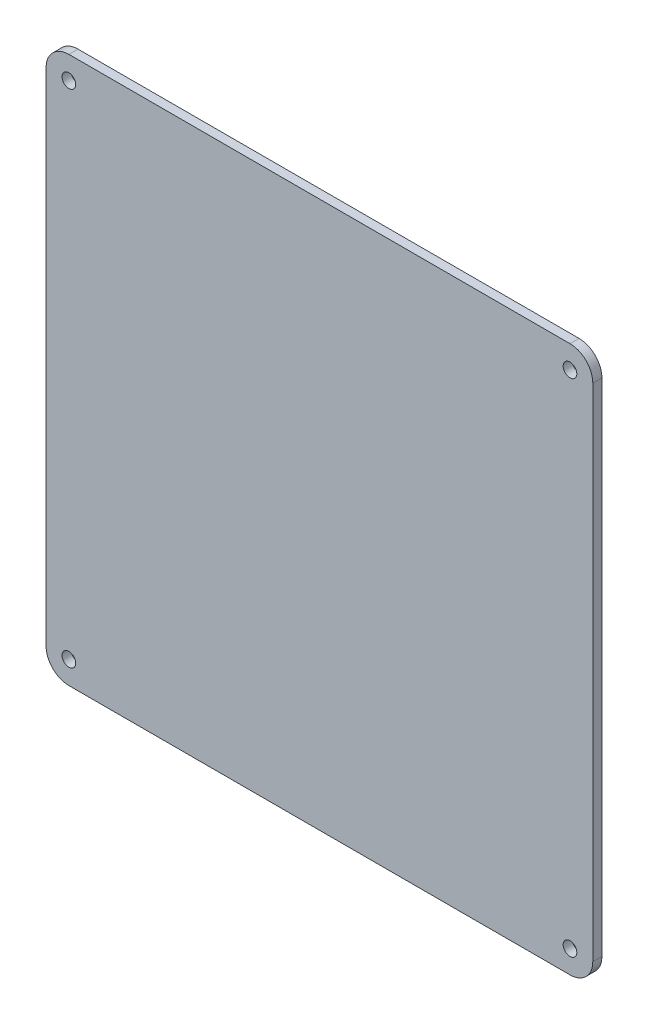
ISO-10303-21;
HEADER;
FILE_DESCRIPTION(('STEP AP214'),'2;1');
FILE_NAME('part.step','',(''),(''),'','','');
FILE_SCHEMA(('AUTOMOTIVE_DESIGN { 1 0 10303 214 1 1 1 1 }'));
ENDSEC;
DATA;
#1=APPLICATION_CONTEXT('core data for automotive mechanical design processes');
#2=APPLICATION_PROTOCOL_DEFINITION('international standard','automotive_design',2000,#1);
#3=PRODUCT_CONTEXT('',#1,'mechanical');
#4=PRODUCT('Part','Part','',(#3));
#5=PRODUCT_RELATED_PRODUCT_CATEGORY('part','',(#4));
#6=PRODUCT_DEFINITION_FORMATION('','',#4);
#7=PRODUCT_DEFINITION_CONTEXT('part definition',#1,'design');
#8=PRODUCT_DEFINITION('design','',#6,#7);
#9=PRODUCT_DEFINITION_SHAPE('','',#8);
#10=(LENGTH_UNIT() NAMED_UNIT(*) SI_UNIT(.MILLI.,.METRE.));
#11=(NAMED_UNIT(*) PLANE_ANGLE_UNIT() SI_UNIT($,.RADIAN.));
#12=(NAMED_UNIT(*) SI_UNIT($,.STERADIAN.) SOLID_ANGLE_UNIT());
#13=UNCERTAINTY_MEASURE_WITH_UNIT(LENGTH_MEASURE(1.E-05),#10,'distance_accuracy_value','');
#14=(GEOMETRIC_REPRESENTATION_CONTEXT(3) GLOBAL_UNCERTAINTY_ASSIGNED_CONTEXT((#13)) GLOBAL_UNIT_ASSIGNED_CONTEXT((#10,
#11,#12)) REPRESENTATION_CONTEXT('',''));
#15=CARTESIAN_POINT('',(0.,0.,0.));
#16=DIRECTION('',(0.,0.,1.));
#17=DIRECTION('',(1.,0.,0.));
#18=AXIS2_PLACEMENT_3D('',#15,#16,#17);
#19=CARTESIAN_POINT('',(55.,-55.,2.));
#20=DIRECTION('',(0.,0.,1.));
#21=DIRECTION('',(1.,0.,0.));
#22=AXIS2_PLACEMENT_3D('',#19,#20,#21);
#23=PLANE('',#22);
#24=CARTESIAN_POINT('',(-55.,-55.,2.));
#25=DIRECTION('',(0.,0.,1.));
#26=DIRECTION('',(-1.,0.,0.));
#27=AXIS2_PLACEMENT_3D('',#24,#25,#26);
#28=CIRCLE('',#27,1.5);
#29=CARTESIAN_POINT('',(-56.5,-55.,2.));
#30=VERTEX_POINT('',#29);
#31=EDGE_CURVE('E188',#30,#30,#28,.T.);
#32=ORIENTED_EDGE('',*,*,#31,.F.);
#33=EDGE_LOOP('',(#32));
#34=FACE_BOUND('',#33,.T.);
#35=CARTESIAN_POINT('',(-55.,55.,2.));
#36=DIRECTION('',(0.,0.,1.));
#37=DIRECTION('',(1.,0.,0.));
#38=AXIS2_PLACEMENT_3D('',#35,#36,#37);
#39=CIRCLE('',#38,1.5);
#40=CARTESIAN_POINT('',(-53.5,55.,2.));
#41=VERTEX_POINT('',#40);
#42=EDGE_CURVE('E134',#41,#41,#39,.T.);
#43=ORIENTED_EDGE('',*,*,#42,.F.);
#44=EDGE_LOOP('',(#43));
#45=FACE_BOUND('',#44,.T.);
#46=CARTESIAN_POINT('',(55.,-55.,2.));
#47=DIRECTION('',(0.,0.,1.));
#48=DIRECTION('',(1.,0.,0.));
#49=AXIS2_PLACEMENT_3D('',#46,#47,#48);
#50=CIRCLE('',#49,4.99999999999999);
#51=CARTESIAN_POINT('',(55.,-60.,2.));
#52=VERTEX_POINT('',#51);
#53=CARTESIAN_POINT('',(60.,-55.,2.));
#54=VERTEX_POINT('',#53);
#55=EDGE_CURVE('E145',#52,#54,#50,.T.);
#56=ORIENTED_EDGE('',*,*,#55,.T.);
#57=DIRECTION('',(0.,1.,0.));
#58=VECTOR('',#57,1.);
#59=CARTESIAN_POINT('',(60.,55.,2.));
#60=LINE('',#59,#58);
#61=CARTESIAN_POINT('',(60.,55.,2.));
#62=VERTEX_POINT('',#61);
#63=EDGE_CURVE('E93',#54,#62,#60,.T.);
#64=ORIENTED_EDGE('',*,*,#63,.T.);
#65=CARTESIAN_POINT('',(55.,55.,2.));
#66=DIRECTION('',(0.,0.,1.));
#67=DIRECTION('',(-1.,0.,0.));
#68=AXIS2_PLACEMENT_3D('',#65,#66,#67);
#69=CIRCLE('',#68,5.);
#70=CARTESIAN_POINT('',(55.,60.,2.));
#71=VERTEX_POINT('',#70);
#72=EDGE_CURVE('E160',#62,#71,#69,.T.);
#73=ORIENTED_EDGE('',*,*,#72,.T.);
#74=DIRECTION('',(-1.,0.,0.));
#75=VECTOR('',#74,1.);
#76=CARTESIAN_POINT('',(-55.,60.,2.));
#77=LINE('',#76,#75);
#78=CARTESIAN_POINT('',(-55.,60.,2.));
#79=VERTEX_POINT('',#78);
#80=EDGE_CURVE('E173',#71,#79,#77,.T.);
#81=ORIENTED_EDGE('',*,*,#80,.T.);
#82=CARTESIAN_POINT('',(-55.,55.,2.));
#83=DIRECTION('',(0.,0.,1.));
#84=DIRECTION('',(1.,0.,0.));
#85=AXIS2_PLACEMENT_3D('',#82,#83,#84);
#86=CIRCLE('',#85,5.);
#87=CARTESIAN_POINT('',(-60.,55.,2.));
#88=VERTEX_POINT('',#87);
#89=EDGE_CURVE('E112',#79,#88,#86,.T.);
#90=ORIENTED_EDGE('',*,*,#89,.T.);
#91=DIRECTION('',(0.,-1.,0.));
#92=VECTOR('',#91,1.);
#93=CARTESIAN_POINT('',(-60.,55.,2.));
#94=LINE('',#93,#92);
#95=CARTESIAN_POINT('',(-60.,-55.,2.));
#96=VERTEX_POINT('',#95);
#97=EDGE_CURVE('E106',#88,#96,#94,.T.);
#98=ORIENTED_EDGE('',*,*,#97,.T.);
#99=CARTESIAN_POINT('',(-55.,-55.,2.));
#100=DIRECTION('',(0.,0.,1.));
#101=DIRECTION('',(1.,0.,0.));
#102=AXIS2_PLACEMENT_3D('',#99,#100,#101);
#103=CIRCLE('',#102,5.);
#104=CARTESIAN_POINT('',(-55.,-60.,2.));
#105=VERTEX_POINT('',#104);
#106=EDGE_CURVE('E110',#96,#105,#103,.T.);
#107=ORIENTED_EDGE('',*,*,#106,.T.);
#108=DIRECTION('',(1.,0.,0.));
#109=VECTOR('',#108,1.);
#110=CARTESIAN_POINT('',(-55.,-60.,2.));
#111=LINE('',#110,#109);
#112=EDGE_CURVE('E50',#105,#52,#111,.T.);
#113=ORIENTED_EDGE('',*,*,#112,.T.);
#114=EDGE_LOOP('',(#56,#64,#73,#81,#90,#98,#107,#113));
#115=FACE_BOUND('',#114,.T.);
#116=CARTESIAN_POINT('',(55.,55.,2.));
#117=DIRECTION('',(0.,0.,1.));
#118=DIRECTION('',(-1.,0.,0.));
#119=AXIS2_PLACEMENT_3D('',#116,#117,#118);
#120=CIRCLE('',#119,1.5);
#121=CARTESIAN_POINT('',(53.5,55.,2.));
#122=VERTEX_POINT('',#121);
#123=EDGE_CURVE('E182',#122,#122,#120,.T.);
#124=ORIENTED_EDGE('',*,*,#123,.F.);
#125=EDGE_LOOP('',(#124));
#126=FACE_BOUND('',#125,.T.);
#127=CARTESIAN_POINT('',(55.,-55.,2.));
#128=DIRECTION('',(0.,0.,1.));
#129=DIRECTION('',(1.,0.,0.));
#130=AXIS2_PLACEMENT_3D('',#127,#128,#129);
#131=CIRCLE('',#130,1.5);
#132=CARTESIAN_POINT('',(56.5,-55.,2.));
#133=VERTEX_POINT('',#132);
#134=EDGE_CURVE('E194',#133,#133,#131,.T.);
#135=ORIENTED_EDGE('',*,*,#134,.F.);
#136=EDGE_LOOP('',(#135));
#137=FACE_BOUND('',#136,.T.);
#138=ADVANCED_FACE('F33',(#34,#45,#115,#126,#137),#23,.T.);
#139=CARTESIAN_POINT('',(55.,-55.,0.));
#140=DIRECTION('',(0.,0.,1.));
#141=DIRECTION('',(1.,0.,0.));
#142=AXIS2_PLACEMENT_3D('',#139,#140,#141);
#143=PLANE('',#142);
#144=CARTESIAN_POINT('',(55.,-55.,0.));
#145=DIRECTION('',(0.,0.,1.));
#146=DIRECTION('',(1.,0.,0.));
#147=AXIS2_PLACEMENT_3D('',#144,#145,#146);
#148=CIRCLE('',#147,4.99999999999999);
#149=CARTESIAN_POINT('',(55.,-60.,0.));
#150=VERTEX_POINT('',#149);
#151=CARTESIAN_POINT('',(60.,-55.,0.));
#152=VERTEX_POINT('',#151);
#153=EDGE_CURVE('E130',#150,#152,#148,.T.);
#154=ORIENTED_EDGE('',*,*,#153,.F.);
#155=DIRECTION('',(1.,0.,0.));
#156=VECTOR('',#155,1.);
#157=CARTESIAN_POINT('',(-55.,-60.,0.));
#158=LINE('',#157,#156);
#159=CARTESIAN_POINT('',(-55.,-60.,0.));
#160=VERTEX_POINT('',#159);
#161=EDGE_CURVE('E85',#160,#150,#158,.T.);
#162=ORIENTED_EDGE('',*,*,#161,.F.);
#163=CARTESIAN_POINT('',(-55.,-55.,0.));
#164=DIRECTION('',(0.,0.,1.));
#165=DIRECTION('',(1.,0.,0.));
#166=AXIS2_PLACEMENT_3D('',#163,#164,#165);
#167=CIRCLE('',#166,5.);
#168=CARTESIAN_POINT('',(-60.,-55.,0.));
#169=VERTEX_POINT('',#168);
#170=EDGE_CURVE('E79',#169,#160,#167,.T.);
#171=ORIENTED_EDGE('',*,*,#170,.F.);
#172=DIRECTION('',(0.,-1.,0.));
#173=VECTOR('',#172,1.);
#174=CARTESIAN_POINT('',(-60.,55.,0.));
#175=LINE('',#174,#173);
#176=CARTESIAN_POINT('',(-60.,55.,0.));
#177=VERTEX_POINT('',#176);
#178=EDGE_CURVE('E120',#177,#169,#175,.T.);
#179=ORIENTED_EDGE('',*,*,#178,.F.);
#180=CARTESIAN_POINT('',(-55.,55.,0.));
#181=DIRECTION('',(0.,0.,1.));
#182=DIRECTION('',(1.,0.,0.));
#183=AXIS2_PLACEMENT_3D('',#180,#181,#182);
#184=CIRCLE('',#183,5.);
#185=CARTESIAN_POINT('',(-55.,60.,0.));
#186=VERTEX_POINT('',#185);
#187=EDGE_CURVE('E140',#186,#177,#184,.T.);
#188=ORIENTED_EDGE('',*,*,#187,.F.);
#189=DIRECTION('',(-1.,0.,0.));
#190=VECTOR('',#189,1.);
#191=CARTESIAN_POINT('',(-55.,60.,0.));
#192=LINE('',#191,#190);
#193=CARTESIAN_POINT('',(55.,60.,0.));
#194=VERTEX_POINT('',#193);
#195=EDGE_CURVE('E138',#194,#186,#192,.T.);
#196=ORIENTED_EDGE('',*,*,#195,.F.);
#197=CARTESIAN_POINT('',(55.,55.,0.));
#198=DIRECTION('',(0.,0.,1.));
#199=DIRECTION('',(-1.,0.,0.));
#200=AXIS2_PLACEMENT_3D('',#197,#198,#199);
#201=CIRCLE('',#200,5.);
#202=CARTESIAN_POINT('',(60.,55.,0.));
#203=VERTEX_POINT('',#202);
#204=EDGE_CURVE('E136',#203,#194,#201,.T.);
#205=ORIENTED_EDGE('',*,*,#204,.F.);
#206=DIRECTION('',(0.,1.,0.));
#207=VECTOR('',#206,1.);
#208=CARTESIAN_POINT('',(60.,55.,0.));
#209=LINE('',#208,#207);
#210=EDGE_CURVE('E133',#152,#203,#209,.T.);
#211=ORIENTED_EDGE('',*,*,#210,.F.);
#212=EDGE_LOOP('',(#154,#162,#171,#179,#188,#196,#205,#211));
#213=FACE_BOUND('',#212,.T.);
#214=CARTESIAN_POINT('',(-55.,55.,0.));
#215=DIRECTION('',(0.,0.,1.));
#216=DIRECTION('',(1.,0.,0.));
#217=AXIS2_PLACEMENT_3D('',#214,#215,#216);
#218=CIRCLE('',#217,1.5);
#219=CARTESIAN_POINT('',(-53.5,55.,0.));
#220=VERTEX_POINT('',#219);
#221=EDGE_CURVE('E179',#220,#220,#218,.T.);
#222=ORIENTED_EDGE('',*,*,#221,.T.);
#223=EDGE_LOOP('',(#222));
#224=FACE_BOUND('',#223,.T.);
#225=CARTESIAN_POINT('',(55.,55.,0.));
#226=DIRECTION('',(0.,0.,1.));
#227=DIRECTION('',(-1.,0.,0.));
#228=AXIS2_PLACEMENT_3D('',#225,#226,#227);
#229=CIRCLE('',#228,1.5);
#230=CARTESIAN_POINT('',(53.5,55.,0.));
#231=VERTEX_POINT('',#230);
#232=EDGE_CURVE('E185',#231,#231,#229,.T.);
#233=ORIENTED_EDGE('',*,*,#232,.T.);
#234=EDGE_LOOP('',(#233));
#235=FACE_BOUND('',#234,.T.);
#236=CARTESIAN_POINT('',(-55.,-55.,0.));
#237=DIRECTION('',(0.,0.,1.));
#238=DIRECTION('',(-1.,0.,0.));
#239=AXIS2_PLACEMENT_3D('',#236,#237,#238);
#240=CIRCLE('',#239,1.5);
#241=CARTESIAN_POINT('',(-56.5,-55.,0.));
#242=VERTEX_POINT('',#241);
#243=EDGE_CURVE('E191',#242,#242,#240,.T.);
#244=ORIENTED_EDGE('',*,*,#243,.T.);
#245=EDGE_LOOP('',(#244));
#246=FACE_BOUND('',#245,.T.);
#247=CARTESIAN_POINT('',(55.,-55.,0.));
#248=DIRECTION('',(0.,0.,1.));
#249=DIRECTION('',(1.,0.,0.));
#250=AXIS2_PLACEMENT_3D('',#247,#248,#249);
#251=CIRCLE('',#250,1.5);
#252=CARTESIAN_POINT('',(56.5,-55.,0.));
#253=VERTEX_POINT('',#252);
#254=EDGE_CURVE('E197',#253,#253,#251,.T.);
#255=ORIENTED_EDGE('',*,*,#254,.T.);
#256=EDGE_LOOP('',(#255));
#257=FACE_BOUND('',#256,.T.);
#258=ADVANCED_FACE('F164',(#213,#224,#235,#246,#257),#143,.F.);
#259=CARTESIAN_POINT('',(55.,-55.,2.));
#260=DIRECTION('',(0.,0.,-1.));
#261=DIRECTION('',(-1.,0.,0.));
#262=AXIS2_PLACEMENT_3D('',#259,#260,#261);
#263=CYLINDRICAL_SURFACE('',#262,4.99999999999999);
#264=ORIENTED_EDGE('',*,*,#153,.T.);
#265=DIRECTION('',(0.,0.,-1.));
#266=VECTOR('',#265,1.);
#267=CARTESIAN_POINT('',(60.,-55.,2.));
#268=LINE('',#267,#266);
#269=EDGE_CURVE('E11',#54,#152,#268,.T.);
#270=ORIENTED_EDGE('',*,*,#269,.F.);
#271=ORIENTED_EDGE('',*,*,#55,.F.);
#272=DIRECTION('',(0.,0.,-1.));
#273=VECTOR('',#272,1.);
#274=CARTESIAN_POINT('',(55.,-60.,2.));
#275=LINE('',#274,#273);
#276=EDGE_CURVE('E126',#52,#150,#275,.T.);
#277=ORIENTED_EDGE('',*,*,#276,.T.);
#278=EDGE_LOOP('',(#264,#270,#271,#277));
#279=FACE_BOUND('',#278,.T.);
#280=ADVANCED_FACE('F35',(#279),#263,.T.);
#281=CARTESIAN_POINT('',(60.,55.,2.));
#282=DIRECTION('',(-1.,0.,0.));
#283=DIRECTION('',(0.,-1.,0.));
#284=AXIS2_PLACEMENT_3D('',#281,#282,#283);
#285=PLANE('',#284);
#286=ORIENTED_EDGE('',*,*,#210,.T.);
#287=DIRECTION('',(0.,0.,-1.));
#288=VECTOR('',#287,1.);
#289=CARTESIAN_POINT('',(60.,55.,2.));
#290=LINE('',#289,#288);
#291=EDGE_CURVE('E42',#62,#203,#290,.T.);
#292=ORIENTED_EDGE('',*,*,#291,.F.);
#293=ORIENTED_EDGE('',*,*,#63,.F.);
#294=ORIENTED_EDGE('',*,*,#269,.T.);
#295=EDGE_LOOP('',(#286,#292,#293,#294));
#296=FACE_BOUND('',#295,.T.);
#297=ADVANCED_FACE('F231',(#296),#285,.F.);
#298=CARTESIAN_POINT('',(55.,55.,2.));
#299=DIRECTION('',(0.,0.,-1.));
#300=DIRECTION('',(-1.,0.,0.));
#301=AXIS2_PLACEMENT_3D('',#298,#299,#300);
#302=CYLINDRICAL_SURFACE('',#301,5.);
#303=ORIENTED_EDGE('',*,*,#204,.T.);
#304=DIRECTION('',(0.,0.,-1.));
#305=VECTOR('',#304,1.);
#306=CARTESIAN_POINT('',(55.,60.,2.));
#307=LINE('',#306,#305);
#308=EDGE_CURVE('E152',#71,#194,#307,.T.);
#309=ORIENTED_EDGE('',*,*,#308,.F.);
#310=ORIENTED_EDGE('',*,*,#72,.F.);
#311=ORIENTED_EDGE('',*,*,#291,.T.);
#312=EDGE_LOOP('',(#303,#309,#310,#311));
#313=FACE_BOUND('',#312,.T.);
#314=ADVANCED_FACE('F158',(#313),#302,.T.);
#315=CARTESIAN_POINT('',(-55.,60.,2.));
#316=DIRECTION('',(0.,-1.,0.));
#317=DIRECTION('',(0.,0.,-1.));
#318=AXIS2_PLACEMENT_3D('',#315,#316,#317);
#319=PLANE('',#318);
#320=ORIENTED_EDGE('',*,*,#195,.T.);
#321=DIRECTION('',(0.,0.,-1.));
#322=VECTOR('',#321,1.);
#323=CARTESIAN_POINT('',(-55.,60.,2.));
#324=LINE('',#323,#322);
#325=EDGE_CURVE('E149',#79,#186,#324,.T.);
#326=ORIENTED_EDGE('',*,*,#325,.F.);
#327=ORIENTED_EDGE('',*,*,#80,.F.);
#328=ORIENTED_EDGE('',*,*,#308,.T.);
#329=EDGE_LOOP('',(#320,#326,#327,#328));
#330=FACE_BOUND('',#329,.T.);
#331=ADVANCED_FACE('F169',(#330),#319,.F.);
#332=CARTESIAN_POINT('',(-55.,55.,2.));
#333=DIRECTION('',(0.,0.,-1.));
#334=DIRECTION('',(-1.,0.,0.));
#335=AXIS2_PLACEMENT_3D('',#332,#333,#334);
#336=CYLINDRICAL_SURFACE('',#335,5.);
#337=ORIENTED_EDGE('',*,*,#187,.T.);
#338=DIRECTION('',(0.,0.,-1.));
#339=VECTOR('',#338,1.);
#340=CARTESIAN_POINT('',(-60.,55.,2.));
#341=LINE('',#340,#339);
#342=EDGE_CURVE('E121',#88,#177,#341,.T.);
#343=ORIENTED_EDGE('',*,*,#342,.F.);
#344=ORIENTED_EDGE('',*,*,#89,.F.);
#345=ORIENTED_EDGE('',*,*,#325,.T.);
#346=EDGE_LOOP('',(#337,#343,#344,#345));
#347=FACE_BOUND('',#346,.T.);
#348=ADVANCED_FACE('F172',(#347),#336,.T.);
#349=CARTESIAN_POINT('',(-60.,55.,2.));
#350=DIRECTION('',(1.,0.,0.));
#351=DIRECTION('',(0.,1.,0.));
#352=AXIS2_PLACEMENT_3D('',#349,#350,#351);
#353=PLANE('',#352);
#354=ORIENTED_EDGE('',*,*,#178,.T.);
#355=DIRECTION('',(0.,0.,-1.));
#356=VECTOR('',#355,1.);
#357=CARTESIAN_POINT('',(-60.,-55.,2.));
#358=LINE('',#357,#356);
#359=EDGE_CURVE('E117',#96,#169,#358,.T.);
#360=ORIENTED_EDGE('',*,*,#359,.F.);
#361=ORIENTED_EDGE('',*,*,#97,.F.);
#362=ORIENTED_EDGE('',*,*,#342,.T.);
#363=EDGE_LOOP('',(#354,#360,#361,#362));
#364=FACE_BOUND('',#363,.T.);
#365=ADVANCED_FACE('F118',(#364),#353,.F.);
#366=CARTESIAN_POINT('',(-55.,-55.,2.));
#367=DIRECTION('',(0.,0.,-1.));
#368=DIRECTION('',(-1.,0.,0.));
#369=AXIS2_PLACEMENT_3D('',#366,#367,#368);
#370=CYLINDRICAL_SURFACE('',#369,5.);
#371=ORIENTED_EDGE('',*,*,#170,.T.);
#372=DIRECTION('',(0.,0.,-1.));
#373=VECTOR('',#372,1.);
#374=CARTESIAN_POINT('',(-55.,-60.,2.));
#375=LINE('',#374,#373);
#376=EDGE_CURVE('E122',#105,#160,#375,.T.);
#377=ORIENTED_EDGE('',*,*,#376,.F.);
#378=ORIENTED_EDGE('',*,*,#106,.F.);
#379=ORIENTED_EDGE('',*,*,#359,.T.);
#380=EDGE_LOOP('',(#371,#377,#378,#379));
#381=FACE_BOUND('',#380,.T.);
#382=ADVANCED_FACE('F124',(#381),#370,.T.);
#383=CARTESIAN_POINT('',(-55.,-60.,2.));
#384=DIRECTION('',(0.,1.,0.));
#385=DIRECTION('',(0.,0.,1.));
#386=AXIS2_PLACEMENT_3D('',#383,#384,#385);
#387=PLANE('',#386);
#388=ORIENTED_EDGE('',*,*,#161,.T.);
#389=ORIENTED_EDGE('',*,*,#276,.F.);
#390=ORIENTED_EDGE('',*,*,#112,.F.);
#391=ORIENTED_EDGE('',*,*,#376,.T.);
#392=EDGE_LOOP('',(#388,#389,#390,#391));
#393=FACE_BOUND('',#392,.T.);
#394=ADVANCED_FACE('F219',(#393),#387,.F.);
#395=CARTESIAN_POINT('',(-55.,55.,2.));
#396=DIRECTION('',(0.,0.,-1.));
#397=DIRECTION('',(-1.,0.,0.));
#398=AXIS2_PLACEMENT_3D('',#395,#396,#397);
#399=CYLINDRICAL_SURFACE('',#398,1.5);
#400=ORIENTED_EDGE('',*,*,#42,.T.);
#401=EDGE_LOOP('',(#400));
#402=FACE_BOUND('',#401,.T.);
#403=ORIENTED_EDGE('',*,*,#221,.F.);
#404=EDGE_LOOP('',(#403));
#405=FACE_BOUND('',#404,.T.);
#406=ADVANCED_FACE('F216',(#402,#405),#399,.F.);
#407=CARTESIAN_POINT('',(55.,55.,2.));
#408=DIRECTION('',(0.,0.,-1.));
#409=DIRECTION('',(-1.,0.,0.));
#410=AXIS2_PLACEMENT_3D('',#407,#408,#409);
#411=CYLINDRICAL_SURFACE('',#410,1.5);
#412=ORIENTED_EDGE('',*,*,#123,.T.);
#413=EDGE_LOOP('',(#412));
#414=FACE_BOUND('',#413,.T.);
#415=ORIENTED_EDGE('',*,*,#232,.F.);
#416=EDGE_LOOP('',(#415));
#417=FACE_BOUND('',#416,.T.);
#418=ADVANCED_FACE('F295',(#414,#417),#411,.F.);
#419=CARTESIAN_POINT('',(-55.,-55.,2.));
#420=DIRECTION('',(0.,0.,-1.));
#421=DIRECTION('',(-1.,0.,0.));
#422=AXIS2_PLACEMENT_3D('',#419,#420,#421);
#423=CYLINDRICAL_SURFACE('',#422,1.5);
#424=ORIENTED_EDGE('',*,*,#31,.T.);
#425=EDGE_LOOP('',(#424));
#426=FACE_BOUND('',#425,.T.);
#427=ORIENTED_EDGE('',*,*,#243,.F.);
#428=EDGE_LOOP('',(#427));
#429=FACE_BOUND('',#428,.T.);
#430=ADVANCED_FACE('F303',(#426,#429),#423,.F.);
#431=CARTESIAN_POINT('',(55.,-55.,2.));
#432=DIRECTION('',(0.,0.,-1.));
#433=DIRECTION('',(-1.,0.,0.));
#434=AXIS2_PLACEMENT_3D('',#431,#432,#433);
#435=CYLINDRICAL_SURFACE('',#434,1.5);
#436=ORIENTED_EDGE('',*,*,#134,.T.);
#437=EDGE_LOOP('',(#436));
#438=FACE_BOUND('',#437,.T.);
#439=ORIENTED_EDGE('',*,*,#254,.F.);
#440=EDGE_LOOP('',(#439));
#441=FACE_BOUND('',#440,.T.);
#442=ADVANCED_FACE('F203',(#438,#441),#435,.F.);
#443=CLOSED_SHELL('',(#138,#258,#280,#297,#314,#331,#348,#365,#382,#394,#406,#418,#430,#442));
#444=MANIFOLD_SOLID_BREP('B2',#443);
#445=ADVANCED_BREP_SHAPE_REPRESENTATION('',(#18,#444),#14);
#446=SHAPE_DEFINITION_REPRESENTATION(#9,#445);
ENDSEC;
END-ISO-10303-21;
